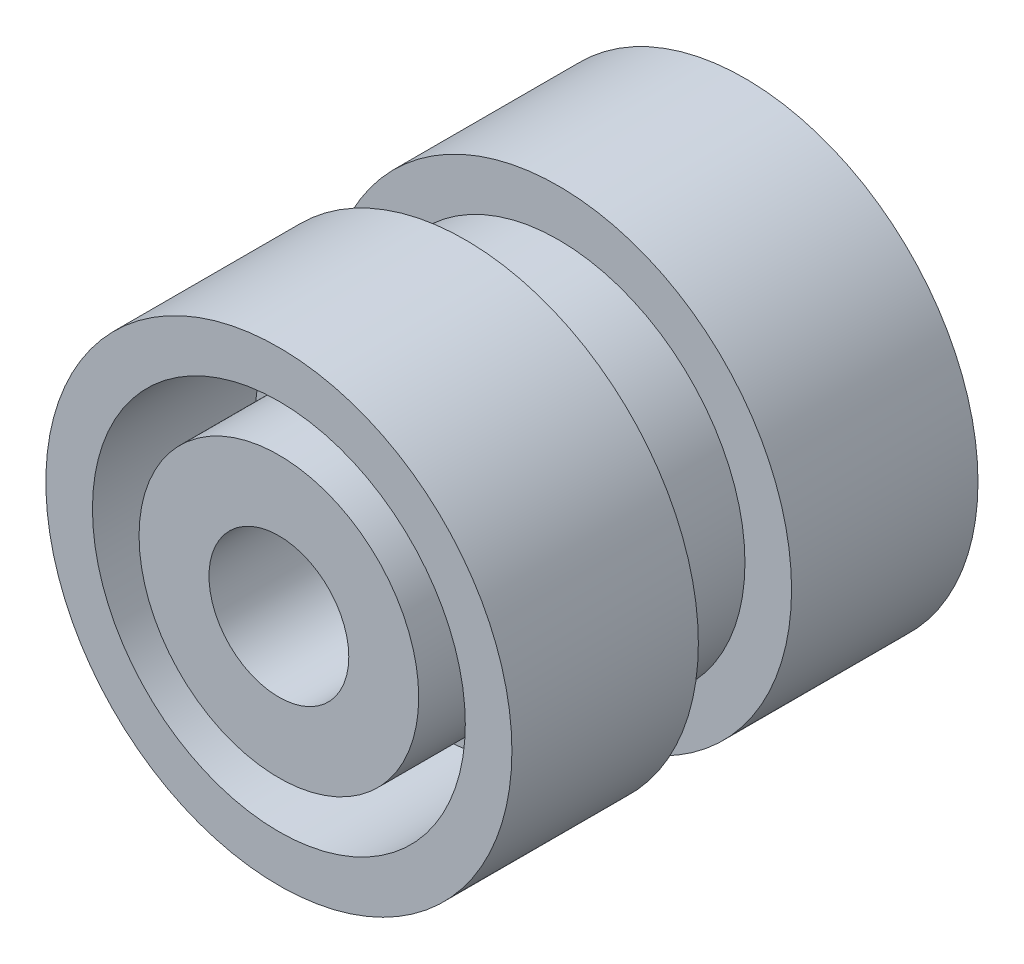
ISO-10303-21;
HEADER;
FILE_DESCRIPTION(('STEP AP214'),'2;1');
FILE_NAME('part.step','',(''),(''),'','','');
FILE_SCHEMA(('AUTOMOTIVE_DESIGN { 1 0 10303 214 1 1 1 1 }'));
ENDSEC;
DATA;
#1=APPLICATION_CONTEXT('core data for automotive mechanical design processes');
#2=APPLICATION_PROTOCOL_DEFINITION('international standard','automotive_design',2000,#1);
#3=PRODUCT_CONTEXT('',#1,'mechanical');
#4=PRODUCT('Part','Part','',(#3));
#5=PRODUCT_RELATED_PRODUCT_CATEGORY('part','',(#4));
#6=PRODUCT_DEFINITION_FORMATION('','',#4);
#7=PRODUCT_DEFINITION_CONTEXT('part definition',#1,'design');
#8=PRODUCT_DEFINITION('design','',#6,#7);
#9=PRODUCT_DEFINITION_SHAPE('','',#8);
#10=(LENGTH_UNIT() NAMED_UNIT(*) SI_UNIT(.MILLI.,.METRE.));
#11=(NAMED_UNIT(*) PLANE_ANGLE_UNIT() SI_UNIT($,.RADIAN.));
#12=(NAMED_UNIT(*) SI_UNIT($,.STERADIAN.) SOLID_ANGLE_UNIT());
#13=UNCERTAINTY_MEASURE_WITH_UNIT(LENGTH_MEASURE(1.E-05),#10,'distance_accuracy_value','');
#14=(GEOMETRIC_REPRESENTATION_CONTEXT(3) GLOBAL_UNCERTAINTY_ASSIGNED_CONTEXT((#13)) GLOBAL_UNIT_ASSIGNED_CONTEXT((#10,
#11,#12)) REPRESENTATION_CONTEXT('',''));
#15=CARTESIAN_POINT('',(0.,0.,0.));
#16=DIRECTION('',(0.,0.,1.));
#17=DIRECTION('',(1.,0.,0.));
#18=AXIS2_PLACEMENT_3D('',#15,#16,#17);
#19=CARTESIAN_POINT('',(0.,8.,-3.35176100657806));
#20=DIRECTION('',(0.,0.,1.));
#21=DIRECTION('',(1.,0.,0.));
#22=AXIS2_PLACEMENT_3D('',#19,#20,#21);
#23=PLANE('',#22);
#24=DIRECTION('',(0.,-1.,0.));
#25=VECTOR('',#24,1.);
#26=CARTESIAN_POINT('',(1.,3.87298334620742,-3.35176100657806));
#27=LINE('',#26,#25);
#28=CARTESIAN_POINT('',(1.,7.93725393319377,-3.35176100657806));
#29=VERTEX_POINT('',#28);
#30=CARTESIAN_POINT('',(1.,3.87298334620742,-3.35176100657806));
#31=VERTEX_POINT('',#30);
#32=EDGE_CURVE('E190',#29,#31,#27,.T.);
#33=ORIENTED_EDGE('',*,*,#32,.F.);
#34=CARTESIAN_POINT('',(0.,0.,-3.35176100657806));
#35=DIRECTION('',(0.,0.,1.));
#36=DIRECTION('',(1.,0.,0.));
#37=AXIS2_PLACEMENT_3D('',#34,#35,#36);
#38=CIRCLE('',#37,8.);
#39=CARTESIAN_POINT('',(7.93725393319377,0.999999999999999,-3.35176100657806));
#40=VERTEX_POINT('',#39);
#41=EDGE_CURVE('E276',#40,#29,#38,.T.);
#42=ORIENTED_EDGE('',*,*,#41,.F.);
#43=DIRECTION('',(1.,0.,0.));
#44=VECTOR('',#43,1.);
#45=CARTESIAN_POINT('',(3.87298334620742,1.,-3.35176100657806));
#46=LINE('',#45,#44);
#47=CARTESIAN_POINT('',(3.87298334620742,1.,-3.35176100657806));
#48=VERTEX_POINT('',#47);
#49=EDGE_CURVE('E197',#48,#40,#46,.T.);
#50=ORIENTED_EDGE('',*,*,#49,.F.);
#51=CARTESIAN_POINT('',(0.,0.,-3.35176100657806));
#52=DIRECTION('',(0.,0.,-1.));
#53=DIRECTION('',(-1.,0.,0.));
#54=AXIS2_PLACEMENT_3D('',#51,#52,#53);
#55=CIRCLE('',#54,4.);
#56=EDGE_CURVE('E193',#31,#48,#55,.T.);
#57=ORIENTED_EDGE('',*,*,#56,.F.);
#58=EDGE_LOOP('',(#33,#42,#50,#57));
#59=FACE_BOUND('',#58,.T.);
#60=ADVANCED_FACE('F38',(#59),#23,.F.);
#61=DIRECTION('',(-1.,0.,0.));
#62=VECTOR('',#61,1.);
#63=CARTESIAN_POINT('',(3.87298334620742,-1.,-3.35176100657806));
#64=LINE('',#63,#62);
#65=CARTESIAN_POINT('',(7.93725393319377,-0.999999999999999,-3.35176100657806));
#66=VERTEX_POINT('',#65);
#67=CARTESIAN_POINT('',(3.87298334620742,-1.,-3.35176100657806));
#68=VERTEX_POINT('',#67);
#69=EDGE_CURVE('E200',#66,#68,#64,.T.);
#70=ORIENTED_EDGE('',*,*,#69,.F.);
#71=CARTESIAN_POINT('',(0.999999999999999,-7.93725393319377,-3.35176100657806));
#72=VERTEX_POINT('',#71);
#73=EDGE_CURVE('E275',#72,#66,#38,.T.);
#74=ORIENTED_EDGE('',*,*,#73,.F.);
#75=DIRECTION('',(0.,-1.,0.));
#76=VECTOR('',#75,1.);
#77=CARTESIAN_POINT('',(1.,-3.87298334620742,-3.35176100657806));
#78=LINE('',#77,#76);
#79=CARTESIAN_POINT('',(1.,-3.87298334620742,-3.35176100657806));
#80=VERTEX_POINT('',#79);
#81=EDGE_CURVE('E206',#80,#72,#78,.T.);
#82=ORIENTED_EDGE('',*,*,#81,.F.);
#83=CARTESIAN_POINT('',(0.,0.,-3.35176100657806));
#84=DIRECTION('',(0.,0.,-1.));
#85=DIRECTION('',(-1.,0.,0.));
#86=AXIS2_PLACEMENT_3D('',#83,#84,#85);
#87=CIRCLE('',#86,4.);
#88=EDGE_CURVE('E203',#68,#80,#87,.T.);
#89=ORIENTED_EDGE('',*,*,#88,.F.);
#90=EDGE_LOOP('',(#70,#74,#82,#89));
#91=FACE_BOUND('',#90,.T.);
#92=ADVANCED_FACE('F395',(#91),#23,.F.);
#93=DIRECTION('',(0.,1.,0.));
#94=VECTOR('',#93,1.);
#95=CARTESIAN_POINT('',(-1.,-3.87298334620742,-3.35176100657806));
#96=LINE('',#95,#94);
#97=CARTESIAN_POINT('',(-0.999999999999999,-7.93725393319377,-3.35176100657806));
#98=VERTEX_POINT('',#97);
#99=CARTESIAN_POINT('',(-1.,-3.87298334620742,-3.35176100657806));
#100=VERTEX_POINT('',#99);
#101=EDGE_CURVE('E209',#98,#100,#96,.T.);
#102=ORIENTED_EDGE('',*,*,#101,.F.);
#103=CARTESIAN_POINT('',(-7.93725393319377,-0.999999999999999,-3.35176100657806));
#104=VERTEX_POINT('',#103);
#105=EDGE_CURVE('E398',#104,#98,#38,.T.);
#106=ORIENTED_EDGE('',*,*,#105,.F.);
#107=DIRECTION('',(-1.,0.,0.));
#108=VECTOR('',#107,1.);
#109=CARTESIAN_POINT('',(-3.87298334620742,-0.999999999999999,-3.35176100657806));
#110=LINE('',#109,#108);
#111=CARTESIAN_POINT('',(-3.87298334620742,-1.,-3.35176100657806));
#112=VERTEX_POINT('',#111);
#113=EDGE_CURVE('E215',#112,#104,#110,.T.);
#114=ORIENTED_EDGE('',*,*,#113,.F.);
#115=CARTESIAN_POINT('',(0.,0.,-3.35176100657806));
#116=DIRECTION('',(0.,0.,-1.));
#117=DIRECTION('',(-1.,0.,0.));
#118=AXIS2_PLACEMENT_3D('',#115,#116,#117);
#119=CIRCLE('',#118,4.);
#120=EDGE_CURVE('E212',#100,#112,#119,.T.);
#121=ORIENTED_EDGE('',*,*,#120,.F.);
#122=EDGE_LOOP('',(#102,#106,#114,#121));
#123=FACE_BOUND('',#122,.T.);
#124=ADVANCED_FACE('F451',(#123),#23,.F.);
#125=DIRECTION('',(1.,0.,0.));
#126=VECTOR('',#125,1.);
#127=CARTESIAN_POINT('',(-3.87298334620742,1.,-3.35176100657806));
#128=LINE('',#127,#126);
#129=CARTESIAN_POINT('',(-7.93725393319377,1.,-3.35176100657806));
#130=VERTEX_POINT('',#129);
#131=CARTESIAN_POINT('',(-3.87298334620742,1.,-3.35176100657806));
#132=VERTEX_POINT('',#131);
#133=EDGE_CURVE('E175',#130,#132,#128,.T.);
#134=ORIENTED_EDGE('',*,*,#133,.F.);
#135=CARTESIAN_POINT('',(-1.,7.93725393319377,-3.35176100657806));
#136=VERTEX_POINT('',#135);
#137=EDGE_CURVE('E281',#136,#130,#38,.T.);
#138=ORIENTED_EDGE('',*,*,#137,.F.);
#139=DIRECTION('',(0.,1.,0.));
#140=VECTOR('',#139,1.);
#141=CARTESIAN_POINT('',(-1.,3.87298334620742,-3.35176100657806));
#142=LINE('',#141,#140);
#143=CARTESIAN_POINT('',(-1.,3.87298334620742,-3.35176100657806));
#144=VERTEX_POINT('',#143);
#145=EDGE_CURVE('E117',#144,#136,#142,.T.);
#146=ORIENTED_EDGE('',*,*,#145,.F.);
#147=CARTESIAN_POINT('',(0.,0.,-3.35176100657806));
#148=DIRECTION('',(0.,0.,-1.));
#149=DIRECTION('',(-1.,0.,0.));
#150=AXIS2_PLACEMENT_3D('',#147,#148,#149);
#151=CIRCLE('',#150,4.);
#152=EDGE_CURVE('E220',#132,#144,#151,.T.);
#153=ORIENTED_EDGE('',*,*,#152,.F.);
#154=EDGE_LOOP('',(#134,#138,#146,#153));
#155=FACE_BOUND('',#154,.T.);
#156=ADVANCED_FACE('F381',(#155),#23,.F.);
#157=CARTESIAN_POINT('',(0.,0.,14.742781630955));
#158=DIRECTION('',(0.,0.,1.));
#159=DIRECTION('',(1.,0.,0.));
#160=AXIS2_PLACEMENT_3D('',#157,#158,#159);
#161=CYLINDRICAL_SURFACE('',#160,8.);
#162=CARTESIAN_POINT('',(0.,0.,-10.3517610065781));
#163=DIRECTION('',(0.,0.,1.));
#164=DIRECTION('',(1.,0.,0.));
#165=AXIS2_PLACEMENT_3D('',#162,#163,#164);
#166=CIRCLE('',#165,8.);
#167=CARTESIAN_POINT('',(8.,0.,-10.3517610065781));
#168=VERTEX_POINT('',#167);
#169=EDGE_CURVE('E280',#168,#168,#166,.T.);
#170=ORIENTED_EDGE('',*,*,#169,.F.);
#171=EDGE_LOOP('',(#170));
#172=FACE_BOUND('',#171,.T.);
#173=DIRECTION('',(0.,0.,1.));
#174=VECTOR('',#173,1.);
#175=CARTESIAN_POINT('',(0.999999999999999,-7.93725393319377,-7.35176100657806));
#176=LINE('',#175,#174);
#177=CARTESIAN_POINT('',(0.999999999999999,-7.93725393319377,-7.35176100657806));
#178=VERTEX_POINT('',#177);
#179=EDGE_CURVE('E245',#178,#72,#176,.T.);
#180=ORIENTED_EDGE('',*,*,#179,.T.);
#181=ORIENTED_EDGE('',*,*,#73,.T.);
#182=DIRECTION('',(0.,0.,1.));
#183=VECTOR('',#182,1.);
#184=CARTESIAN_POINT('',(7.93725393319377,-0.999999999999999,-7.35176100657806));
#185=LINE('',#184,#183);
#186=CARTESIAN_POINT('',(7.93725393319377,-0.999999999999999,-7.35176100657806));
#187=VERTEX_POINT('',#186);
#188=EDGE_CURVE('E257',#187,#66,#185,.T.);
#189=ORIENTED_EDGE('',*,*,#188,.F.);
#190=CARTESIAN_POINT('',(0.,0.,-7.35176100657806));
#191=DIRECTION('',(0.,0.,-1.));
#192=DIRECTION('',(-1.,0.,0.));
#193=AXIS2_PLACEMENT_3D('',#190,#191,#192);
#194=CIRCLE('',#193,8.);
#195=CARTESIAN_POINT('',(7.93725393319377,0.999999999999999,-7.35176100657806));
#196=VERTEX_POINT('',#195);
#197=EDGE_CURVE('E423',#196,#187,#194,.T.);
#198=ORIENTED_EDGE('',*,*,#197,.F.);
#199=DIRECTION('',(0.,0.,1.));
#200=VECTOR('',#199,1.);
#201=CARTESIAN_POINT('',(7.93725393319377,0.999999999999999,-7.35176100657806));
#202=LINE('',#201,#200);
#203=EDGE_CURVE('E260',#196,#40,#202,.T.);
#204=ORIENTED_EDGE('',*,*,#203,.T.);
#205=ORIENTED_EDGE('',*,*,#41,.T.);
#206=DIRECTION('',(0.,0.,1.));
#207=VECTOR('',#206,1.);
#208=CARTESIAN_POINT('',(1.,7.93725393319377,-7.35176100657806));
#209=LINE('',#208,#207);
#210=CARTESIAN_POINT('',(1.,7.93725393319377,-7.35176100657806));
#211=VERTEX_POINT('',#210);
#212=EDGE_CURVE('E272',#211,#29,#209,.T.);
#213=ORIENTED_EDGE('',*,*,#212,.F.);
#214=CARTESIAN_POINT('',(0.,0.,-7.35176100657806));
#215=DIRECTION('',(0.,0.,-1.));
#216=DIRECTION('',(-1.,0.,0.));
#217=AXIS2_PLACEMENT_3D('',#214,#215,#216);
#218=CIRCLE('',#217,8.);
#219=CARTESIAN_POINT('',(-1.,7.93725393319377,-7.35176100657806));
#220=VERTEX_POINT('',#219);
#221=EDGE_CURVE('E225',#220,#211,#218,.T.);
#222=ORIENTED_EDGE('',*,*,#221,.F.);
#223=DIRECTION('',(0.,0.,1.));
#224=VECTOR('',#223,1.);
#225=CARTESIAN_POINT('',(-1.,7.93725393319377,-7.35176100657806));
#226=LINE('',#225,#224);
#227=EDGE_CURVE('E186',#220,#136,#226,.T.);
#228=ORIENTED_EDGE('',*,*,#227,.T.);
#229=ORIENTED_EDGE('',*,*,#137,.T.);
#230=DIRECTION('',(0.,0.,1.));
#231=VECTOR('',#230,1.);
#232=CARTESIAN_POINT('',(-7.93725393319377,1.,-7.35176100657806));
#233=LINE('',#232,#231);
#234=CARTESIAN_POINT('',(-7.93725393319377,1.,-7.35176100657806));
#235=VERTEX_POINT('',#234);
#236=EDGE_CURVE('E179',#235,#130,#233,.T.);
#237=ORIENTED_EDGE('',*,*,#236,.F.);
#238=CARTESIAN_POINT('',(0.,0.,-7.35176100657806));
#239=DIRECTION('',(0.,0.,-1.));
#240=DIRECTION('',(-1.,0.,0.));
#241=AXIS2_PLACEMENT_3D('',#238,#239,#240);
#242=CIRCLE('',#241,8.);
#243=CARTESIAN_POINT('',(-7.93725393319377,-0.999999999999999,-7.35176100657806));
#244=VERTEX_POINT('',#243);
#245=EDGE_CURVE('E166',#244,#235,#242,.T.);
#246=ORIENTED_EDGE('',*,*,#245,.F.);
#247=DIRECTION('',(0.,0.,1.));
#248=VECTOR('',#247,1.);
#249=CARTESIAN_POINT('',(-7.93725393319377,-0.999999999999999,-7.35176100657806));
#250=LINE('',#249,#248);
#251=EDGE_CURVE('E53',#244,#104,#250,.T.);
#252=ORIENTED_EDGE('',*,*,#251,.T.);
#253=ORIENTED_EDGE('',*,*,#105,.T.);
#254=DIRECTION('',(0.,0.,1.));
#255=VECTOR('',#254,1.);
#256=CARTESIAN_POINT('',(-0.999999999999999,-7.93725393319377,-7.35176100657806));
#257=LINE('',#256,#255);
#258=CARTESIAN_POINT('',(-0.999999999999999,-7.93725393319377,-7.35176100657806));
#259=VERTEX_POINT('',#258);
#260=EDGE_CURVE('E242',#259,#98,#257,.T.);
#261=ORIENTED_EDGE('',*,*,#260,.F.);
#262=CARTESIAN_POINT('',(0.,0.,-7.35176100657806));
#263=DIRECTION('',(0.,0.,-1.));
#264=DIRECTION('',(-1.,0.,0.));
#265=AXIS2_PLACEMENT_3D('',#262,#263,#264);
#266=CIRCLE('',#265,8.);
#267=EDGE_CURVE('E389',#178,#259,#266,.T.);
#268=ORIENTED_EDGE('',*,*,#267,.F.);
#269=EDGE_LOOP('',(#180,#181,#189,#198,#204,#205,#213,#222,#228,#229,#237,#246,#252,#253,#261,#268));
#270=FACE_BOUND('',#269,.T.);
#271=ADVANCED_FACE('F377',(#172,#270),#161,.F.);
#272=CARTESIAN_POINT('',(0.,0.,9.64823899342194));
#273=DIRECTION('',(0.,0.,-1.));
#274=DIRECTION('',(-1.,0.,0.));
#275=AXIS2_PLACEMENT_3D('',#272,#273,#274);
#276=PLANE('',#275);
#277=CARTESIAN_POINT('',(0.,0.,9.64823899342194));
#278=DIRECTION('',(0.,0.,1.));
#279=DIRECTION('',(1.,0.,0.));
#280=AXIS2_PLACEMENT_3D('',#277,#278,#279);
#281=CIRCLE('',#280,3.);
#282=CARTESIAN_POINT('',(3.,0.,9.64823899342194));
#283=VERTEX_POINT('',#282);
#284=EDGE_CURVE('E415',#283,#283,#281,.T.);
#285=ORIENTED_EDGE('',*,*,#284,.F.);
#286=EDGE_LOOP('',(#285));
#287=FACE_BOUND('',#286,.T.);
#288=CARTESIAN_POINT('',(0.,0.,9.64823899342194));
#289=DIRECTION('',(0.,0.,1.));
#290=DIRECTION('',(1.,0.,0.));
#291=AXIS2_PLACEMENT_3D('',#288,#289,#290);
#292=CIRCLE('',#291,6.);
#293=CARTESIAN_POINT('',(6.,0.,9.64823899342194));
#294=VERTEX_POINT('',#293);
#295=EDGE_CURVE('E11',#294,#294,#292,.T.);
#296=ORIENTED_EDGE('',*,*,#295,.T.);
#297=EDGE_LOOP('',(#296));
#298=FACE_BOUND('',#297,.T.);
#299=ADVANCED_FACE('F380',(#287,#298),#276,.F.);
#300=CARTESIAN_POINT('',(0.,0.,14.742781630955));
#301=DIRECTION('',(0.,0.,1.));
#302=DIRECTION('',(1.,0.,0.));
#303=AXIS2_PLACEMENT_3D('',#300,#301,#302);
#304=CYLINDRICAL_SURFACE('',#303,6.);
#305=ORIENTED_EDGE('',*,*,#295,.F.);
#306=EDGE_LOOP('',(#305));
#307=FACE_BOUND('',#306,.T.);
#308=CARTESIAN_POINT('',(0.,0.,2.64823899342194));
#309=DIRECTION('',(0.,0.,1.));
#310=DIRECTION('',(1.,0.,0.));
#311=AXIS2_PLACEMENT_3D('',#308,#309,#310);
#312=CIRCLE('',#311,6.);
#313=CARTESIAN_POINT('',(6.,0.,2.64823899342194));
#314=VERTEX_POINT('',#313);
#315=EDGE_CURVE('E46',#314,#314,#312,.T.);
#316=ORIENTED_EDGE('',*,*,#315,.T.);
#317=EDGE_LOOP('',(#316));
#318=FACE_BOUND('',#317,.T.);
#319=ADVANCED_FACE('F320',(#307,#318),#304,.T.);
#320=CARTESIAN_POINT('',(0.,6.,2.64823899342194));
#321=DIRECTION('',(0.,0.,-1.));
#322=DIRECTION('',(-1.,0.,0.));
#323=AXIS2_PLACEMENT_3D('',#320,#321,#322);
#324=PLANE('',#323);
#325=ORIENTED_EDGE('',*,*,#315,.F.);
#326=EDGE_LOOP('',(#325));
#327=FACE_BOUND('',#326,.T.);
#328=CARTESIAN_POINT('',(0.,0.,2.64823899342194));
#329=DIRECTION('',(0.,0.,1.));
#330=DIRECTION('',(1.,0.,0.));
#331=AXIS2_PLACEMENT_3D('',#328,#329,#330);
#332=CIRCLE('',#331,8.);
#333=CARTESIAN_POINT('',(8.,0.,2.64823899342194));
#334=VERTEX_POINT('',#333);
#335=EDGE_CURVE('E313',#334,#334,#332,.T.);
#336=ORIENTED_EDGE('',*,*,#335,.T.);
#337=EDGE_LOOP('',(#336));
#338=FACE_BOUND('',#337,.T.);
#339=ADVANCED_FACE('F322',(#327,#338),#324,.F.);
#340=CARTESIAN_POINT('',(0.,0.,14.742781630955));
#341=DIRECTION('',(0.,0.,1.));
#342=DIRECTION('',(1.,0.,0.));
#343=AXIS2_PLACEMENT_3D('',#340,#341,#342);
#344=CYLINDRICAL_SURFACE('',#343,8.);
#345=ORIENTED_EDGE('',*,*,#335,.F.);
#346=EDGE_LOOP('',(#345));
#347=FACE_BOUND('',#346,.T.);
#348=CARTESIAN_POINT('',(0.,0.,9.64823899342194));
#349=DIRECTION('',(0.,0.,1.));
#350=DIRECTION('',(1.,0.,0.));
#351=AXIS2_PLACEMENT_3D('',#348,#349,#350);
#352=CIRCLE('',#351,8.);
#353=CARTESIAN_POINT('',(8.,0.,9.64823899342194));
#354=VERTEX_POINT('',#353);
#355=EDGE_CURVE('E309',#354,#354,#352,.T.);
#356=ORIENTED_EDGE('',*,*,#355,.T.);
#357=EDGE_LOOP('',(#356));
#358=FACE_BOUND('',#357,.T.);
#359=ADVANCED_FACE('F325',(#347,#358),#344,.F.);
#360=CARTESIAN_POINT('',(0.,8.,9.64823899342194));
#361=DIRECTION('',(0.,0.,-1.));
#362=DIRECTION('',(-1.,0.,0.));
#363=AXIS2_PLACEMENT_3D('',#360,#361,#362);
#364=PLANE('',#363);
#365=ORIENTED_EDGE('',*,*,#355,.F.);
#366=EDGE_LOOP('',(#365));
#367=FACE_BOUND('',#366,.T.);
#368=CARTESIAN_POINT('',(0.,0.,9.64823899342194));
#369=DIRECTION('',(0.,0.,1.));
#370=DIRECTION('',(1.,0.,0.));
#371=AXIS2_PLACEMENT_3D('',#368,#369,#370);
#372=CIRCLE('',#371,10.);
#373=CARTESIAN_POINT('',(10.,0.,9.64823899342194));
#374=VERTEX_POINT('',#373);
#375=EDGE_CURVE('E305',#374,#374,#372,.T.);
#376=ORIENTED_EDGE('',*,*,#375,.T.);
#377=EDGE_LOOP('',(#376));
#378=FACE_BOUND('',#377,.T.);
#379=ADVANCED_FACE('F331',(#367,#378),#364,.F.);
#380=CARTESIAN_POINT('',(0.,0.,14.742781630955));
#381=DIRECTION('',(0.,0.,1.));
#382=DIRECTION('',(1.,0.,0.));
#383=AXIS2_PLACEMENT_3D('',#380,#381,#382);
#384=CYLINDRICAL_SURFACE('',#383,10.);
#385=ORIENTED_EDGE('',*,*,#375,.F.);
#386=EDGE_LOOP('',(#385));
#387=FACE_BOUND('',#386,.T.);
#388=CARTESIAN_POINT('',(0.,0.,1.64823899342194));
#389=DIRECTION('',(0.,0.,1.));
#390=DIRECTION('',(1.,0.,0.));
#391=AXIS2_PLACEMENT_3D('',#388,#389,#390);
#392=CIRCLE('',#391,10.);
#393=CARTESIAN_POINT('',(10.,0.,1.64823899342194));
#394=VERTEX_POINT('',#393);
#395=EDGE_CURVE('E301',#394,#394,#392,.T.);
#396=ORIENTED_EDGE('',*,*,#395,.T.);
#397=EDGE_LOOP('',(#396));
#398=FACE_BOUND('',#397,.T.);
#399=ADVANCED_FACE('F337',(#387,#398),#384,.T.);
#400=CARTESIAN_POINT('',(0.,10.,1.64823899342194));
#401=DIRECTION('',(0.,0.,1.));
#402=DIRECTION('',(1.,0.,0.));
#403=AXIS2_PLACEMENT_3D('',#400,#401,#402);
#404=PLANE('',#403);
#405=ORIENTED_EDGE('',*,*,#395,.F.);
#406=EDGE_LOOP('',(#405));
#407=FACE_BOUND('',#406,.T.);
#408=CARTESIAN_POINT('',(0.,0.,1.64823899342194));
#409=DIRECTION('',(0.,0.,1.));
#410=DIRECTION('',(1.,0.,0.));
#411=AXIS2_PLACEMENT_3D('',#408,#409,#410);
#412=CIRCLE('',#411,8.);
#413=CARTESIAN_POINT('',(8.,0.,1.64823899342194));
#414=VERTEX_POINT('',#413);
#415=EDGE_CURVE('E297',#414,#414,#412,.T.);
#416=ORIENTED_EDGE('',*,*,#415,.T.);
#417=EDGE_LOOP('',(#416));
#418=FACE_BOUND('',#417,.T.);
#419=ADVANCED_FACE('F343',(#407,#418),#404,.F.);
#420=CARTESIAN_POINT('',(0.,0.,14.742781630955));
#421=DIRECTION('',(0.,0.,1.));
#422=DIRECTION('',(1.,0.,0.));
#423=AXIS2_PLACEMENT_3D('',#420,#421,#422);
#424=CYLINDRICAL_SURFACE('',#423,8.);
#425=ORIENTED_EDGE('',*,*,#415,.F.);
#426=EDGE_LOOP('',(#425));
#427=FACE_BOUND('',#426,.T.);
#428=CARTESIAN_POINT('',(0.,0.,-2.35176100657806));
#429=DIRECTION('',(0.,0.,1.));
#430=DIRECTION('',(1.,0.,0.));
#431=AXIS2_PLACEMENT_3D('',#428,#429,#430);
#432=CIRCLE('',#431,8.);
#433=CARTESIAN_POINT('',(8.,0.,-2.35176100657806));
#434=VERTEX_POINT('',#433);
#435=EDGE_CURVE('E293',#434,#434,#432,.T.);
#436=ORIENTED_EDGE('',*,*,#435,.T.);
#437=EDGE_LOOP('',(#436));
#438=FACE_BOUND('',#437,.T.);
#439=ADVANCED_FACE('F349',(#427,#438),#424,.T.);
#440=CARTESIAN_POINT('',(0.,10.,-2.35176100657806));
#441=DIRECTION('',(0.,0.,-1.));
#442=DIRECTION('',(-1.,0.,0.));
#443=AXIS2_PLACEMENT_3D('',#440,#441,#442);
#444=PLANE('',#443);
#445=ORIENTED_EDGE('',*,*,#435,.F.);
#446=EDGE_LOOP('',(#445));
#447=FACE_BOUND('',#446,.T.);
#448=CARTESIAN_POINT('',(0.,0.,-2.35176100657806));
#449=DIRECTION('',(0.,0.,1.));
#450=DIRECTION('',(1.,0.,0.));
#451=AXIS2_PLACEMENT_3D('',#448,#449,#450);
#452=CIRCLE('',#451,10.);
#453=CARTESIAN_POINT('',(10.,0.,-2.35176100657806));
#454=VERTEX_POINT('',#453);
#455=EDGE_CURVE('E289',#454,#454,#452,.T.);
#456=ORIENTED_EDGE('',*,*,#455,.T.);
#457=EDGE_LOOP('',(#456));
#458=FACE_BOUND('',#457,.T.);
#459=ADVANCED_FACE('F355',(#447,#458),#444,.F.);
#460=CARTESIAN_POINT('',(0.,0.,14.742781630955));
#461=DIRECTION('',(0.,0.,1.));
#462=DIRECTION('',(1.,0.,0.));
#463=AXIS2_PLACEMENT_3D('',#460,#461,#462);
#464=CYLINDRICAL_SURFACE('',#463,10.);
#465=ORIENTED_EDGE('',*,*,#455,.F.);
#466=EDGE_LOOP('',(#465));
#467=FACE_BOUND('',#466,.T.);
#468=CARTESIAN_POINT('',(0.,0.,-10.3517610065781));
#469=DIRECTION('',(0.,0.,1.));
#470=DIRECTION('',(1.,0.,0.));
#471=AXIS2_PLACEMENT_3D('',#468,#469,#470);
#472=CIRCLE('',#471,10.);
#473=CARTESIAN_POINT('',(10.,0.,-10.3517610065781));
#474=VERTEX_POINT('',#473);
#475=EDGE_CURVE('E285',#474,#474,#472,.T.);
#476=ORIENTED_EDGE('',*,*,#475,.T.);
#477=EDGE_LOOP('',(#476));
#478=FACE_BOUND('',#477,.T.);
#479=ADVANCED_FACE('F361',(#467,#478),#464,.T.);
#480=CARTESIAN_POINT('',(0.,8.,-10.3517610065781));
#481=DIRECTION('',(0.,0.,1.));
#482=DIRECTION('',(1.,0.,0.));
#483=AXIS2_PLACEMENT_3D('',#480,#481,#482);
#484=PLANE('',#483);
#485=ORIENTED_EDGE('',*,*,#475,.F.);
#486=EDGE_LOOP('',(#485));
#487=FACE_BOUND('',#486,.T.);
#488=ORIENTED_EDGE('',*,*,#169,.T.);
#489=EDGE_LOOP('',(#488));
#490=FACE_BOUND('',#489,.T.);
#491=ADVANCED_FACE('F367',(#487,#490),#484,.F.);
#492=CARTESIAN_POINT('',(1.,3.87298334620742,-7.35176100657806));
#493=DIRECTION('',(-1.,0.,0.));
#494=DIRECTION('',(0.,0.,1.));
#495=AXIS2_PLACEMENT_3D('',#492,#493,#494);
#496=PLANE('',#495);
#497=ORIENTED_EDGE('',*,*,#32,.T.);
#498=DIRECTION('',(0.,0.,1.));
#499=VECTOR('',#498,1.);
#500=CARTESIAN_POINT('',(1.,3.87298334620742,-7.35176100657806));
#501=LINE('',#500,#499);
#502=CARTESIAN_POINT('',(1.,3.87298334620742,-7.35176100657806));
#503=VERTEX_POINT('',#502);
#504=EDGE_CURVE('E268',#503,#31,#501,.T.);
#505=ORIENTED_EDGE('',*,*,#504,.F.);
#506=DIRECTION('',(0.,-1.,0.));
#507=VECTOR('',#506,1.);
#508=CARTESIAN_POINT('',(1.,3.87298334620742,-7.35176100657806));
#509=LINE('',#508,#507);
#510=EDGE_CURVE('E125',#211,#503,#509,.T.);
#511=ORIENTED_EDGE('',*,*,#510,.F.);
#512=ORIENTED_EDGE('',*,*,#212,.T.);
#513=EDGE_LOOP('',(#497,#505,#511,#512));
#514=FACE_BOUND('',#513,.T.);
#515=ADVANCED_FACE('F373',(#514),#496,.F.);
#516=CARTESIAN_POINT('',(0.,0.,-7.35176100657806));
#517=DIRECTION('',(0.,0.,1.));
#518=DIRECTION('',(1.,0.,0.));
#519=AXIS2_PLACEMENT_3D('',#516,#517,#518);
#520=CYLINDRICAL_SURFACE('',#519,4.);
#521=ORIENTED_EDGE('',*,*,#56,.T.);
#522=DIRECTION('',(0.,0.,1.));
#523=VECTOR('',#522,1.);
#524=CARTESIAN_POINT('',(3.87298334620742,1.,-7.35176100657806));
#525=LINE('',#524,#523);
#526=CARTESIAN_POINT('',(3.87298334620742,1.,-7.35176100657806));
#527=VERTEX_POINT('',#526);
#528=EDGE_CURVE('E264',#527,#48,#525,.T.);
#529=ORIENTED_EDGE('',*,*,#528,.F.);
#530=CARTESIAN_POINT('',(0.,0.,-7.35176100657806));
#531=DIRECTION('',(0.,0.,-1.));
#532=DIRECTION('',(-1.,0.,0.));
#533=AXIS2_PLACEMENT_3D('',#530,#531,#532);
#534=CIRCLE('',#533,4.);
#535=EDGE_CURVE('E412',#503,#527,#534,.T.);
#536=ORIENTED_EDGE('',*,*,#535,.F.);
#537=ORIENTED_EDGE('',*,*,#504,.T.);
#538=EDGE_LOOP('',(#521,#529,#536,#537));
#539=FACE_BOUND('',#538,.T.);
#540=ADVANCED_FACE('F498',(#539),#520,.T.);
#541=CARTESIAN_POINT('',(3.87298334620742,1.,-7.35176100657806));
#542=DIRECTION('',(0.,-1.,0.));
#543=DIRECTION('',(1.,0.,0.));
#544=AXIS2_PLACEMENT_3D('',#541,#542,#543);
#545=PLANE('',#544);
#546=ORIENTED_EDGE('',*,*,#49,.T.);
#547=ORIENTED_EDGE('',*,*,#203,.F.);
#548=DIRECTION('',(1.,0.,0.));
#549=VECTOR('',#548,1.);
#550=CARTESIAN_POINT('',(3.87298334620742,1.,-7.35176100657806));
#551=LINE('',#550,#549);
#552=EDGE_CURVE('E420',#527,#196,#551,.T.);
#553=ORIENTED_EDGE('',*,*,#552,.F.);
#554=ORIENTED_EDGE('',*,*,#528,.T.);
#555=EDGE_LOOP('',(#546,#547,#553,#554));
#556=FACE_BOUND('',#555,.T.);
#557=ADVANCED_FACE('F507',(#556),#545,.F.);
#558=CARTESIAN_POINT('',(3.87298334620742,-1.,-7.35176100657806));
#559=DIRECTION('',(0.,1.,0.));
#560=DIRECTION('',(-1.,0.,0.));
#561=AXIS2_PLACEMENT_3D('',#558,#559,#560);
#562=PLANE('',#561);
#563=ORIENTED_EDGE('',*,*,#69,.T.);
#564=DIRECTION('',(0.,0.,1.));
#565=VECTOR('',#564,1.);
#566=CARTESIAN_POINT('',(3.87298334620742,-1.,-7.35176100657806));
#567=LINE('',#566,#565);
#568=CARTESIAN_POINT('',(3.87298334620742,-1.,-7.35176100657806));
#569=VERTEX_POINT('',#568);
#570=EDGE_CURVE('E253',#569,#68,#567,.T.);
#571=ORIENTED_EDGE('',*,*,#570,.F.);
#572=DIRECTION('',(-1.,0.,0.));
#573=VECTOR('',#572,1.);
#574=CARTESIAN_POINT('',(3.87298334620742,-1.,-7.35176100657806));
#575=LINE('',#574,#573);
#576=EDGE_CURVE('E426',#187,#569,#575,.T.);
#577=ORIENTED_EDGE('',*,*,#576,.F.);
#578=ORIENTED_EDGE('',*,*,#188,.T.);
#579=EDGE_LOOP('',(#563,#571,#577,#578));
#580=FACE_BOUND('',#579,.T.);
#581=ADVANCED_FACE('F516',(#580),#562,.F.);
#582=CARTESIAN_POINT('',(0.,0.,-7.35176100657806));
#583=DIRECTION('',(0.,0.,1.));
#584=DIRECTION('',(1.,0.,0.));
#585=AXIS2_PLACEMENT_3D('',#582,#583,#584);
#586=CYLINDRICAL_SURFACE('',#585,4.);
#587=ORIENTED_EDGE('',*,*,#88,.T.);
#588=DIRECTION('',(0.,0.,1.));
#589=VECTOR('',#588,1.);
#590=CARTESIAN_POINT('',(1.,-3.87298334620742,-7.35176100657806));
#591=LINE('',#590,#589);
#592=CARTESIAN_POINT('',(1.,-3.87298334620742,-7.35176100657806));
#593=VERTEX_POINT('',#592);
#594=EDGE_CURVE('E249',#593,#80,#591,.T.);
#595=ORIENTED_EDGE('',*,*,#594,.F.);
#596=CARTESIAN_POINT('',(0.,0.,-7.35176100657806));
#597=DIRECTION('',(0.,0.,-1.));
#598=DIRECTION('',(-1.,0.,0.));
#599=AXIS2_PLACEMENT_3D('',#596,#597,#598);
#600=CIRCLE('',#599,4.);
#601=EDGE_CURVE('E429',#569,#593,#600,.T.);
#602=ORIENTED_EDGE('',*,*,#601,.F.);
#603=ORIENTED_EDGE('',*,*,#570,.T.);
#604=EDGE_LOOP('',(#587,#595,#602,#603));
#605=FACE_BOUND('',#604,.T.);
#606=ADVANCED_FACE('F525',(#605),#586,.T.);
#607=CARTESIAN_POINT('',(1.,-3.87298334620742,-7.35176100657806));
#608=DIRECTION('',(-1.,0.,0.));
#609=DIRECTION('',(0.,-1.,0.));
#610=AXIS2_PLACEMENT_3D('',#607,#608,#609);
#611=PLANE('',#610);
#612=ORIENTED_EDGE('',*,*,#81,.T.);
#613=ORIENTED_EDGE('',*,*,#179,.F.);
#614=DIRECTION('',(0.,-1.,0.));
#615=VECTOR('',#614,1.);
#616=CARTESIAN_POINT('',(1.,-3.87298334620742,-7.35176100657806));
#617=LINE('',#616,#615);
#618=EDGE_CURVE('E432',#593,#178,#617,.T.);
#619=ORIENTED_EDGE('',*,*,#618,.F.);
#620=ORIENTED_EDGE('',*,*,#594,.T.);
#621=EDGE_LOOP('',(#612,#613,#619,#620));
#622=FACE_BOUND('',#621,.T.);
#623=ADVANCED_FACE('F534',(#622),#611,.F.);
#624=CARTESIAN_POINT('',(-1.,-3.87298334620742,-7.35176100657806));
#625=DIRECTION('',(1.,0.,0.));
#626=DIRECTION('',(0.,1.,0.));
#627=AXIS2_PLACEMENT_3D('',#624,#625,#626);
#628=PLANE('',#627);
#629=ORIENTED_EDGE('',*,*,#101,.T.);
#630=DIRECTION('',(0.,0.,1.));
#631=VECTOR('',#630,1.);
#632=CARTESIAN_POINT('',(-1.,-3.87298334620742,-7.35176100657806));
#633=LINE('',#632,#631);
#634=CARTESIAN_POINT('',(-1.,-3.87298334620742,-7.35176100657806));
#635=VERTEX_POINT('',#634);
#636=EDGE_CURVE('E238',#635,#100,#633,.T.);
#637=ORIENTED_EDGE('',*,*,#636,.F.);
#638=DIRECTION('',(0.,1.,0.));
#639=VECTOR('',#638,1.);
#640=CARTESIAN_POINT('',(-1.,-3.87298334620742,-7.35176100657806));
#641=LINE('',#640,#639);
#642=EDGE_CURVE('E437',#259,#635,#641,.T.);
#643=ORIENTED_EDGE('',*,*,#642,.F.);
#644=ORIENTED_EDGE('',*,*,#260,.T.);
#645=EDGE_LOOP('',(#629,#637,#643,#644));
#646=FACE_BOUND('',#645,.T.);
#647=ADVANCED_FACE('F455',(#646),#628,.F.);
#648=CARTESIAN_POINT('',(0.,0.,-7.35176100657806));
#649=DIRECTION('',(0.,0.,1.));
#650=DIRECTION('',(1.,0.,0.));
#651=AXIS2_PLACEMENT_3D('',#648,#649,#650);
#652=CYLINDRICAL_SURFACE('',#651,4.);
#653=ORIENTED_EDGE('',*,*,#120,.T.);
#654=DIRECTION('',(0.,0.,1.));
#655=VECTOR('',#654,1.);
#656=CARTESIAN_POINT('',(-3.87298334620742,-1.,-7.35176100657806));
#657=LINE('',#656,#655);
#658=CARTESIAN_POINT('',(-3.87298334620742,-1.,-7.35176100657806));
#659=VERTEX_POINT('',#658);
#660=EDGE_CURVE('E234',#659,#112,#657,.T.);
#661=ORIENTED_EDGE('',*,*,#660,.F.);
#662=CARTESIAN_POINT('',(0.,0.,-7.35176100657806));
#663=DIRECTION('',(0.,0.,-1.));
#664=DIRECTION('',(-1.,0.,0.));
#665=AXIS2_PLACEMENT_3D('',#662,#663,#664);
#666=CIRCLE('',#665,4.);
#667=EDGE_CURVE('E440',#635,#659,#666,.T.);
#668=ORIENTED_EDGE('',*,*,#667,.F.);
#669=ORIENTED_EDGE('',*,*,#636,.T.);
#670=EDGE_LOOP('',(#653,#661,#668,#669));
#671=FACE_BOUND('',#670,.T.);
#672=ADVANCED_FACE('F458',(#671),#652,.T.);
#673=CARTESIAN_POINT('',(-3.87298334620742,-0.999999999999999,-7.35176100657806));
#674=DIRECTION('',(0.,1.,0.));
#675=DIRECTION('',(-1.,0.,0.));
#676=AXIS2_PLACEMENT_3D('',#673,#674,#675);
#677=PLANE('',#676);
#678=ORIENTED_EDGE('',*,*,#113,.T.);
#679=ORIENTED_EDGE('',*,*,#251,.F.);
#680=DIRECTION('',(-1.,0.,0.));
#681=VECTOR('',#680,1.);
#682=CARTESIAN_POINT('',(-3.87298334620742,-0.999999999999999,-7.35176100657806));
#683=LINE('',#682,#681);
#684=EDGE_CURVE('E443',#659,#244,#683,.T.);
#685=ORIENTED_EDGE('',*,*,#684,.F.);
#686=ORIENTED_EDGE('',*,*,#660,.T.);
#687=EDGE_LOOP('',(#678,#679,#685,#686));
#688=FACE_BOUND('',#687,.T.);
#689=ADVANCED_FACE('F459',(#688),#677,.F.);
#690=CARTESIAN_POINT('',(-3.87298334620742,1.,-7.35176100657806));
#691=DIRECTION('',(0.,-1.,0.));
#692=DIRECTION('',(1.,0.,0.));
#693=AXIS2_PLACEMENT_3D('',#690,#691,#692);
#694=PLANE('',#693);
#695=ORIENTED_EDGE('',*,*,#133,.T.);
#696=DIRECTION('',(0.,0.,1.));
#697=VECTOR('',#696,1.);
#698=CARTESIAN_POINT('',(-3.87298334620742,1.,-7.35176100657806));
#699=LINE('',#698,#697);
#700=CARTESIAN_POINT('',(-3.87298334620742,1.,-7.35176100657806));
#701=VERTEX_POINT('',#700);
#702=EDGE_CURVE('E172',#701,#132,#699,.T.);
#703=ORIENTED_EDGE('',*,*,#702,.F.);
#704=DIRECTION('',(1.,0.,0.));
#705=VECTOR('',#704,1.);
#706=CARTESIAN_POINT('',(-3.87298334620742,1.,-7.35176100657806));
#707=LINE('',#706,#705);
#708=EDGE_CURVE('E159',#235,#701,#707,.T.);
#709=ORIENTED_EDGE('',*,*,#708,.F.);
#710=ORIENTED_EDGE('',*,*,#236,.T.);
#711=EDGE_LOOP('',(#695,#703,#709,#710));
#712=FACE_BOUND('',#711,.T.);
#713=ADVANCED_FACE('F173',(#712),#694,.F.);
#714=CARTESIAN_POINT('',(0.,0.,-7.35176100657806));
#715=DIRECTION('',(0.,0.,1.));
#716=DIRECTION('',(1.,0.,0.));
#717=AXIS2_PLACEMENT_3D('',#714,#715,#716);
#718=CYLINDRICAL_SURFACE('',#717,4.);
#719=ORIENTED_EDGE('',*,*,#152,.T.);
#720=DIRECTION('',(0.,0.,1.));
#721=VECTOR('',#720,1.);
#722=CARTESIAN_POINT('',(-1.,3.87298334620742,-7.35176100657806));
#723=LINE('',#722,#721);
#724=CARTESIAN_POINT('',(-1.,3.87298334620742,-7.35176100657806));
#725=VERTEX_POINT('',#724);
#726=EDGE_CURVE('E180',#725,#144,#723,.T.);
#727=ORIENTED_EDGE('',*,*,#726,.F.);
#728=CARTESIAN_POINT('',(0.,0.,-7.35176100657806));
#729=DIRECTION('',(0.,0.,-1.));
#730=DIRECTION('',(-1.,0.,0.));
#731=AXIS2_PLACEMENT_3D('',#728,#729,#730);
#732=CIRCLE('',#731,4.);
#733=EDGE_CURVE('E163',#701,#725,#732,.T.);
#734=ORIENTED_EDGE('',*,*,#733,.F.);
#735=ORIENTED_EDGE('',*,*,#702,.T.);
#736=EDGE_LOOP('',(#719,#727,#734,#735));
#737=FACE_BOUND('',#736,.T.);
#738=ADVANCED_FACE('F182',(#737),#718,.T.);
#739=CARTESIAN_POINT('',(-1.,3.87298334620742,-7.35176100657806));
#740=DIRECTION('',(1.,0.,0.));
#741=DIRECTION('',(0.,0.,-1.));
#742=AXIS2_PLACEMENT_3D('',#739,#740,#741);
#743=PLANE('',#742);
#744=ORIENTED_EDGE('',*,*,#145,.T.);
#745=ORIENTED_EDGE('',*,*,#227,.F.);
#746=DIRECTION('',(0.,1.,0.));
#747=VECTOR('',#746,1.);
#748=CARTESIAN_POINT('',(-1.,3.87298334620742,-7.35176100657806));
#749=LINE('',#748,#747);
#750=EDGE_CURVE('E62',#725,#220,#749,.T.);
#751=ORIENTED_EDGE('',*,*,#750,.F.);
#752=ORIENTED_EDGE('',*,*,#726,.T.);
#753=EDGE_LOOP('',(#744,#745,#751,#752));
#754=FACE_BOUND('',#753,.T.);
#755=ADVANCED_FACE('F407',(#754),#743,.F.);
#756=CARTESIAN_POINT('',(0.,0.,-7.35176100657806));
#757=DIRECTION('',(0.,0.,-1.));
#758=DIRECTION('',(-1.,0.,0.));
#759=AXIS2_PLACEMENT_3D('',#756,#757,#758);
#760=PLANE('',#759);
#761=ORIENTED_EDGE('',*,*,#221,.T.);
#762=ORIENTED_EDGE('',*,*,#510,.T.);
#763=ORIENTED_EDGE('',*,*,#535,.T.);
#764=ORIENTED_EDGE('',*,*,#552,.T.);
#765=ORIENTED_EDGE('',*,*,#197,.T.);
#766=ORIENTED_EDGE('',*,*,#576,.T.);
#767=ORIENTED_EDGE('',*,*,#601,.T.);
#768=ORIENTED_EDGE('',*,*,#618,.T.);
#769=ORIENTED_EDGE('',*,*,#267,.T.);
#770=ORIENTED_EDGE('',*,*,#642,.T.);
#771=ORIENTED_EDGE('',*,*,#667,.T.);
#772=ORIENTED_EDGE('',*,*,#684,.T.);
#773=ORIENTED_EDGE('',*,*,#245,.T.);
#774=ORIENTED_EDGE('',*,*,#708,.T.);
#775=ORIENTED_EDGE('',*,*,#733,.T.);
#776=ORIENTED_EDGE('',*,*,#750,.T.);
#777=EDGE_LOOP('',(#761,#762,#763,#764,#765,#766,#767,#768,#769,#770,#771,#772,#773,#774,#775,#776));
#778=FACE_BOUND('',#777,.T.);
#779=ADVANCED_FACE('F161',(#778),#760,.T.);
#780=CARTESIAN_POINT('',(0.,0.,-6.35176100657806));
#781=DIRECTION('',(0.,0.,1.));
#782=DIRECTION('',(1.,0.,0.));
#783=AXIS2_PLACEMENT_3D('',#780,#781,#782);
#784=CYLINDRICAL_SURFACE('',#783,3.);
#785=CARTESIAN_POINT('',(0.,0.,-6.35176100657806));
#786=DIRECTION('',(0.,0.,1.));
#787=DIRECTION('',(1.,0.,0.));
#788=AXIS2_PLACEMENT_3D('',#785,#786,#787);
#789=CIRCLE('',#788,3.);
#790=CARTESIAN_POINT('',(3.,0.,-6.35176100657806));
#791=VERTEX_POINT('',#790);
#792=EDGE_CURVE('E194',#791,#791,#789,.T.);
#793=ORIENTED_EDGE('',*,*,#792,.F.);
#794=EDGE_LOOP('',(#793));
#795=FACE_BOUND('',#794,.T.);
#796=ORIENTED_EDGE('',*,*,#284,.T.);
#797=EDGE_LOOP('',(#796));
#798=FACE_BOUND('',#797,.T.);
#799=ADVANCED_FACE('F585',(#795,#798),#784,.F.);
#800=CARTESIAN_POINT('',(0.,0.,-6.35176100657806));
#801=DIRECTION('',(0.,0.,1.));
#802=DIRECTION('',(1.,0.,0.));
#803=AXIS2_PLACEMENT_3D('',#800,#801,#802);
#804=PLANE('',#803);
#805=ORIENTED_EDGE('',*,*,#792,.T.);
#806=EDGE_LOOP('',(#805));
#807=FACE_BOUND('',#806,.T.);
#808=ADVANCED_FACE('F593',(#807),#804,.T.);
#809=CLOSED_SHELL('',(#60,#92,#124,#156,#271,#299,#319,#339,#359,#379,#399,#419,#439,#459,#479,
#491,#515,#540,#557,#581,#606,#623,#647,#672,#689,#713,#738,#755,#779,#799,#808));
#810=MANIFOLD_SOLID_BREP('B2',#809);
#811=ADVANCED_BREP_SHAPE_REPRESENTATION('',(#18,#810),#14);
#812=SHAPE_DEFINITION_REPRESENTATION(#9,#811);
ENDSEC;
END-ISO-10303-21;
